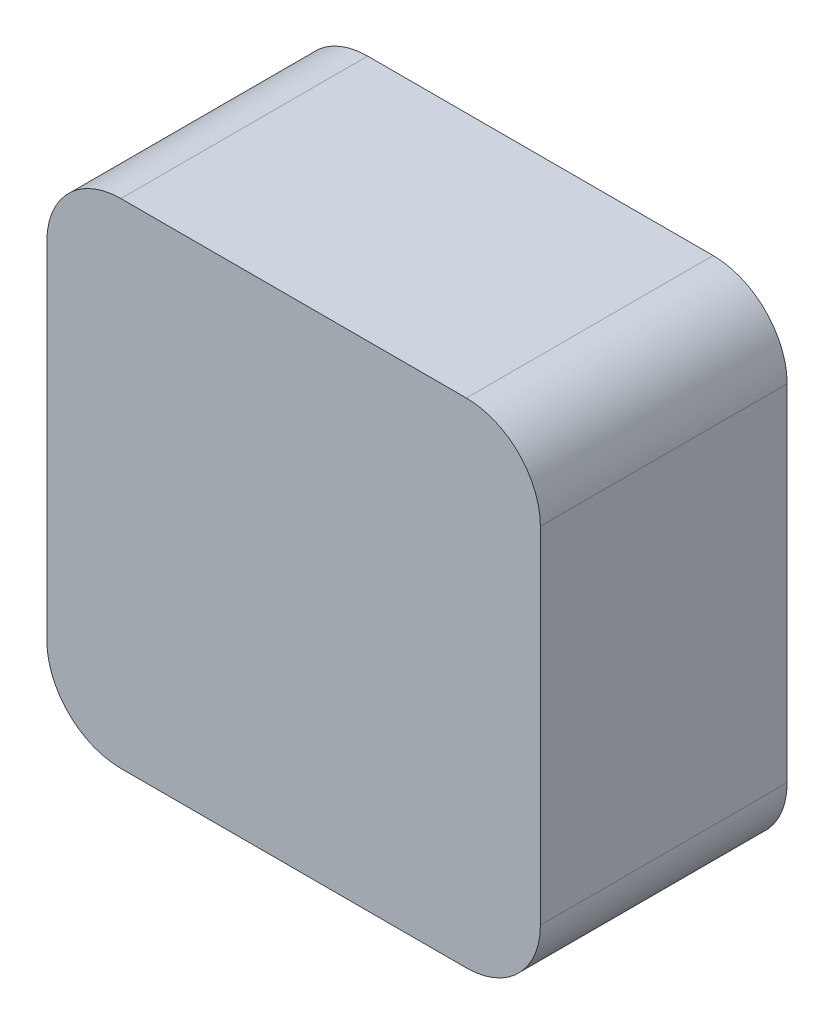
ISO-10303-21;
HEADER;
FILE_DESCRIPTION(('STEP AP214'),'2;1');
FILE_NAME('part.step','',(''),(''),'','','');
FILE_SCHEMA(('AUTOMOTIVE_DESIGN { 1 0 10303 214 1 1 1 1 }'));
ENDSEC;
DATA;
#1=APPLICATION_CONTEXT('core data for automotive mechanical design processes');
#2=APPLICATION_PROTOCOL_DEFINITION('international standard','automotive_design',2000,#1);
#3=PRODUCT_CONTEXT('',#1,'mechanical');
#4=PRODUCT('Part','Part','',(#3));
#5=PRODUCT_RELATED_PRODUCT_CATEGORY('part','',(#4));
#6=PRODUCT_DEFINITION_FORMATION('','',#4);
#7=PRODUCT_DEFINITION_CONTEXT('part definition',#1,'design');
#8=PRODUCT_DEFINITION('design','',#6,#7);
#9=PRODUCT_DEFINITION_SHAPE('','',#8);
#10=(LENGTH_UNIT() NAMED_UNIT(*) SI_UNIT(.MILLI.,.METRE.));
#11=(NAMED_UNIT(*) PLANE_ANGLE_UNIT() SI_UNIT($,.RADIAN.));
#12=(NAMED_UNIT(*) SI_UNIT($,.STERADIAN.) SOLID_ANGLE_UNIT());
#13=UNCERTAINTY_MEASURE_WITH_UNIT(LENGTH_MEASURE(1.E-05),#10,'distance_accuracy_value','');
#14=(GEOMETRIC_REPRESENTATION_CONTEXT(3) GLOBAL_UNCERTAINTY_ASSIGNED_CONTEXT((#13)) GLOBAL_UNIT_ASSIGNED_CONTEXT((#10,
#11,#12)) REPRESENTATION_CONTEXT('',''));
#15=CARTESIAN_POINT('',(0.,0.,0.));
#16=DIRECTION('',(0.,0.,1.));
#17=DIRECTION('',(1.,0.,0.));
#18=AXIS2_PLACEMENT_3D('',#15,#16,#17);
#19=CARTESIAN_POINT('',(0.,0.,5.));
#20=DIRECTION('',(0.,0.,1.));
#21=DIRECTION('',(1.,0.,0.));
#22=AXIS2_PLACEMENT_3D('',#19,#20,#21);
#23=PLANE('',#22);
#24=DIRECTION('',(0.,-1.,0.));
#25=VECTOR('',#24,1.);
#26=CARTESIAN_POINT('',(-145.000000000007,160.499999999999,5.));
#27=LINE('',#26,#25);
#28=CARTESIAN_POINT('',(-145.000000000007,158.999999999999,5.));
#29=VERTEX_POINT('',#28);
#30=CARTESIAN_POINT('',(-145.000000000007,151.999999999999,5.));
#31=VERTEX_POINT('',#30);
#32=EDGE_CURVE('E140',#29,#31,#27,.T.);
#33=ORIENTED_EDGE('',*,*,#32,.T.);
#34=CARTESIAN_POINT('',(-143.500000000007,151.999999999999,5.));
#35=DIRECTION('',(0.,0.,1.));
#36=DIRECTION('',(1.,0.,0.));
#37=AXIS2_PLACEMENT_3D('',#34,#35,#36);
#38=CIRCLE('',#37,1.5);
#39=CARTESIAN_POINT('',(-143.500000000007,150.499999999999,5.));
#40=VERTEX_POINT('',#39);
#41=EDGE_CURVE('E155',#31,#40,#38,.T.);
#42=ORIENTED_EDGE('',*,*,#41,.T.);
#43=DIRECTION('',(1.,0.,0.));
#44=VECTOR('',#43,1.);
#45=CARTESIAN_POINT('',(-145.000000000007,150.499999999999,5.));
#46=LINE('',#45,#44);
#47=CARTESIAN_POINT('',(-136.500000000007,150.499999999999,5.));
#48=VERTEX_POINT('',#47);
#49=EDGE_CURVE('E123',#40,#48,#46,.T.);
#50=ORIENTED_EDGE('',*,*,#49,.T.);
#51=CARTESIAN_POINT('',(-136.500000000007,151.999999999999,5.));
#52=DIRECTION('',(0.,0.,1.));
#53=DIRECTION('',(1.,0.,0.));
#54=AXIS2_PLACEMENT_3D('',#51,#52,#53);
#55=CIRCLE('',#54,1.5);
#56=CARTESIAN_POINT('',(-135.000000000007,151.999999999999,5.));
#57=VERTEX_POINT('',#56);
#58=EDGE_CURVE('E150',#48,#57,#55,.T.);
#59=ORIENTED_EDGE('',*,*,#58,.T.);
#60=DIRECTION('',(0.,1.,0.));
#61=VECTOR('',#60,1.);
#62=CARTESIAN_POINT('',(-135.000000000007,160.499999999999,5.));
#63=LINE('',#62,#61);
#64=CARTESIAN_POINT('',(-135.000000000007,158.999999999999,5.));
#65=VERTEX_POINT('',#64);
#66=EDGE_CURVE('E166',#57,#65,#63,.T.);
#67=ORIENTED_EDGE('',*,*,#66,.T.);
#68=CARTESIAN_POINT('',(-136.500000000007,158.999999999999,5.));
#69=DIRECTION('',(0.,0.,1.));
#70=DIRECTION('',(1.,0.,0.));
#71=AXIS2_PLACEMENT_3D('',#68,#69,#70);
#72=CIRCLE('',#71,1.5);
#73=CARTESIAN_POINT('',(-136.500000000007,160.499999999999,5.));
#74=VERTEX_POINT('',#73);
#75=EDGE_CURVE('E59',#65,#74,#72,.T.);
#76=ORIENTED_EDGE('',*,*,#75,.T.);
#77=DIRECTION('',(-1.,0.,0.));
#78=VECTOR('',#77,1.);
#79=CARTESIAN_POINT('',(-145.000000000007,160.499999999999,5.));
#80=LINE('',#79,#78);
#81=CARTESIAN_POINT('',(-143.500000000007,160.499999999999,5.));
#82=VERTEX_POINT('',#81);
#83=EDGE_CURVE('E141',#74,#82,#80,.T.);
#84=ORIENTED_EDGE('',*,*,#83,.T.);
#85=CARTESIAN_POINT('',(-143.500000000007,158.999999999999,5.));
#86=DIRECTION('',(0.,0.,1.));
#87=DIRECTION('',(1.,0.,0.));
#88=AXIS2_PLACEMENT_3D('',#85,#86,#87);
#89=CIRCLE('',#88,1.5);
#90=EDGE_CURVE('E153',#82,#29,#89,.T.);
#91=ORIENTED_EDGE('',*,*,#90,.T.);
#92=EDGE_LOOP('',(#33,#42,#50,#59,#67,#76,#84,#91));
#93=FACE_BOUND('',#92,.T.);
#94=ADVANCED_FACE('F37',(#93),#23,.T.);
#95=CARTESIAN_POINT('',(0.,0.,0.));
#96=DIRECTION('',(0.,0.,1.));
#97=DIRECTION('',(1.,0.,0.));
#98=AXIS2_PLACEMENT_3D('',#95,#96,#97);
#99=PLANE('',#98);
#100=CARTESIAN_POINT('',(-140.000000000007,155.499999999999,0.));
#101=DIRECTION('',(0.,0.,-1.));
#102=DIRECTION('',(-1.,0.,0.));
#103=AXIS2_PLACEMENT_3D('',#100,#101,#102);
#104=CIRCLE('',#103,2.25000000000001);
#105=CARTESIAN_POINT('',(-142.250000000007,155.499999999999,0.));
#106=VERTEX_POINT('',#105);
#107=EDGE_CURVE('E180',#106,#106,#104,.T.);
#108=ORIENTED_EDGE('',*,*,#107,.F.);
#109=EDGE_LOOP('',(#108));
#110=FACE_BOUND('',#109,.T.);
#111=DIRECTION('',(1.,0.,0.));
#112=VECTOR('',#111,1.);
#113=CARTESIAN_POINT('',(-145.000000000007,150.499999999999,0.));
#114=LINE('',#113,#112);
#115=CARTESIAN_POINT('',(-143.500000000007,150.499999999999,0.));
#116=VERTEX_POINT('',#115);
#117=CARTESIAN_POINT('',(-136.500000000007,150.499999999999,0.));
#118=VERTEX_POINT('',#117);
#119=EDGE_CURVE('E120',#116,#118,#114,.T.);
#120=ORIENTED_EDGE('',*,*,#119,.F.);
#121=CARTESIAN_POINT('',(-143.500000000007,151.999999999999,0.));
#122=DIRECTION('',(0.,0.,1.));
#123=DIRECTION('',(1.,0.,0.));
#124=AXIS2_PLACEMENT_3D('',#121,#122,#123);
#125=CIRCLE('',#124,1.5);
#126=CARTESIAN_POINT('',(-145.000000000007,151.999999999999,0.));
#127=VERTEX_POINT('',#126);
#128=EDGE_CURVE('E103',#116,#127,#125,.F.);
#129=ORIENTED_EDGE('',*,*,#128,.T.);
#130=DIRECTION('',(0.,-1.,0.));
#131=VECTOR('',#130,1.);
#132=CARTESIAN_POINT('',(-145.000000000007,160.499999999999,0.));
#133=LINE('',#132,#131);
#134=CARTESIAN_POINT('',(-145.000000000007,158.999999999999,0.));
#135=VERTEX_POINT('',#134);
#136=EDGE_CURVE('E130',#135,#127,#133,.T.);
#137=ORIENTED_EDGE('',*,*,#136,.F.);
#138=CARTESIAN_POINT('',(-143.500000000007,158.999999999999,0.));
#139=DIRECTION('',(0.,0.,1.));
#140=DIRECTION('',(1.,0.,0.));
#141=AXIS2_PLACEMENT_3D('',#138,#139,#140);
#142=CIRCLE('',#141,1.5);
#143=CARTESIAN_POINT('',(-143.500000000007,160.499999999999,0.));
#144=VERTEX_POINT('',#143);
#145=EDGE_CURVE('E114',#135,#144,#142,.F.);
#146=ORIENTED_EDGE('',*,*,#145,.T.);
#147=DIRECTION('',(-1.,0.,0.));
#148=VECTOR('',#147,1.);
#149=CARTESIAN_POINT('',(-145.000000000007,160.499999999999,0.));
#150=LINE('',#149,#148);
#151=CARTESIAN_POINT('',(-136.500000000007,160.499999999999,0.));
#152=VERTEX_POINT('',#151);
#153=EDGE_CURVE('E133',#152,#144,#150,.T.);
#154=ORIENTED_EDGE('',*,*,#153,.F.);
#155=CARTESIAN_POINT('',(-136.500000000007,158.999999999999,0.));
#156=DIRECTION('',(0.,0.,1.));
#157=DIRECTION('',(1.,0.,0.));
#158=AXIS2_PLACEMENT_3D('',#155,#156,#157);
#159=CIRCLE('',#158,1.5);
#160=CARTESIAN_POINT('',(-135.000000000007,158.999999999999,0.));
#161=VERTEX_POINT('',#160);
#162=EDGE_CURVE('E144',#152,#161,#159,.F.);
#163=ORIENTED_EDGE('',*,*,#162,.T.);
#164=DIRECTION('',(0.,1.,0.));
#165=VECTOR('',#164,1.);
#166=CARTESIAN_POINT('',(-135.000000000007,160.499999999999,0.));
#167=LINE('',#166,#165);
#168=CARTESIAN_POINT('',(-135.000000000007,151.999999999999,0.));
#169=VERTEX_POINT('',#168);
#170=EDGE_CURVE('E129',#169,#161,#167,.T.);
#171=ORIENTED_EDGE('',*,*,#170,.F.);
#172=CARTESIAN_POINT('',(-136.500000000007,151.999999999999,0.));
#173=DIRECTION('',(0.,0.,1.));
#174=DIRECTION('',(1.,0.,0.));
#175=AXIS2_PLACEMENT_3D('',#172,#173,#174);
#176=CIRCLE('',#175,1.5);
#177=EDGE_CURVE('E124',#169,#118,#176,.F.);
#178=ORIENTED_EDGE('',*,*,#177,.T.);
#179=EDGE_LOOP('',(#120,#129,#137,#146,#154,#163,#171,#178));
#180=FACE_BOUND('',#179,.T.);
#181=ADVANCED_FACE('F127',(#110,#180),#99,.F.);
#182=CARTESIAN_POINT('',(-145.000000000007,160.499999999999,5.));
#183=DIRECTION('',(1.,0.,0.));
#184=DIRECTION('',(0.,0.,-1.));
#185=AXIS2_PLACEMENT_3D('',#182,#183,#184);
#186=PLANE('',#185);
#187=ORIENTED_EDGE('',*,*,#136,.T.);
#188=DIRECTION('',(0.,0.,-1.));
#189=VECTOR('',#188,1.);
#190=CARTESIAN_POINT('',(-145.000000000007,151.999999999999,5.));
#191=LINE('',#190,#189);
#192=EDGE_CURVE('E108',#127,#31,#191,.F.);
#193=ORIENTED_EDGE('',*,*,#192,.T.);
#194=ORIENTED_EDGE('',*,*,#32,.F.);
#195=DIRECTION('',(0.,0.,-1.));
#196=VECTOR('',#195,1.);
#197=CARTESIAN_POINT('',(-145.000000000007,158.999999999999,5.));
#198=LINE('',#197,#196);
#199=EDGE_CURVE('E113',#29,#135,#198,.T.);
#200=ORIENTED_EDGE('',*,*,#199,.T.);
#201=EDGE_LOOP('',(#187,#193,#194,#200));
#202=FACE_BOUND('',#201,.T.);
#203=ADVANCED_FACE('F195',(#202),#186,.F.);
#204=CARTESIAN_POINT('',(-145.000000000007,150.499999999999,5.));
#205=DIRECTION('',(0.,1.,0.));
#206=DIRECTION('',(0.,0.,1.));
#207=AXIS2_PLACEMENT_3D('',#204,#205,#206);
#208=PLANE('',#207);
#209=ORIENTED_EDGE('',*,*,#49,.F.);
#210=DIRECTION('',(0.,0.,-1.));
#211=VECTOR('',#210,1.);
#212=CARTESIAN_POINT('',(-143.500000000007,150.499999999999,5.));
#213=LINE('',#212,#211);
#214=EDGE_CURVE('E107',#40,#116,#213,.T.);
#215=ORIENTED_EDGE('',*,*,#214,.T.);
#216=ORIENTED_EDGE('',*,*,#119,.T.);
#217=DIRECTION('',(0.,0.,-1.));
#218=VECTOR('',#217,1.);
#219=CARTESIAN_POINT('',(-136.500000000007,150.499999999999,5.));
#220=LINE('',#219,#218);
#221=EDGE_CURVE('E125',#118,#48,#220,.F.);
#222=ORIENTED_EDGE('',*,*,#221,.T.);
#223=EDGE_LOOP('',(#209,#215,#216,#222));
#224=FACE_BOUND('',#223,.T.);
#225=ADVANCED_FACE('F119',(#224),#208,.F.);
#226=CARTESIAN_POINT('',(-135.000000000007,160.499999999999,5.));
#227=DIRECTION('',(-1.,0.,0.));
#228=DIRECTION('',(0.,0.,1.));
#229=AXIS2_PLACEMENT_3D('',#226,#227,#228);
#230=PLANE('',#229);
#231=ORIENTED_EDGE('',*,*,#170,.T.);
#232=DIRECTION('',(0.,0.,-1.));
#233=VECTOR('',#232,1.);
#234=CARTESIAN_POINT('',(-135.000000000007,158.999999999999,5.));
#235=LINE('',#234,#233);
#236=EDGE_CURVE('E11',#161,#65,#235,.F.);
#237=ORIENTED_EDGE('',*,*,#236,.T.);
#238=ORIENTED_EDGE('',*,*,#66,.F.);
#239=DIRECTION('',(0.,0.,-1.));
#240=VECTOR('',#239,1.);
#241=CARTESIAN_POINT('',(-135.000000000007,151.999999999999,5.));
#242=LINE('',#241,#240);
#243=EDGE_CURVE('E45',#57,#169,#242,.T.);
#244=ORIENTED_EDGE('',*,*,#243,.T.);
#245=EDGE_LOOP('',(#231,#237,#238,#244));
#246=FACE_BOUND('',#245,.T.);
#247=ADVANCED_FACE('F164',(#246),#230,.F.);
#248=CARTESIAN_POINT('',(-145.000000000007,160.499999999999,5.));
#249=DIRECTION('',(0.,-1.,0.));
#250=DIRECTION('',(0.,0.,-1.));
#251=AXIS2_PLACEMENT_3D('',#248,#249,#250);
#252=PLANE('',#251);
#253=ORIENTED_EDGE('',*,*,#153,.T.);
#254=DIRECTION('',(0.,0.,-1.));
#255=VECTOR('',#254,1.);
#256=CARTESIAN_POINT('',(-143.500000000007,160.499999999999,5.));
#257=LINE('',#256,#255);
#258=EDGE_CURVE('E52',#144,#82,#257,.F.);
#259=ORIENTED_EDGE('',*,*,#258,.T.);
#260=ORIENTED_EDGE('',*,*,#83,.F.);
#261=DIRECTION('',(0.,0.,-1.));
#262=VECTOR('',#261,1.);
#263=CARTESIAN_POINT('',(-136.500000000007,160.499999999999,5.));
#264=LINE('',#263,#262);
#265=EDGE_CURVE('E157',#74,#152,#264,.T.);
#266=ORIENTED_EDGE('',*,*,#265,.T.);
#267=EDGE_LOOP('',(#253,#259,#260,#266));
#268=FACE_BOUND('',#267,.T.);
#269=ADVANCED_FACE('F173',(#268),#252,.F.);
#270=CARTESIAN_POINT('',(-143.500000000007,151.999999999999,5.));
#271=DIRECTION('',(0.,0.,-1.));
#272=DIRECTION('',(-1.,0.,0.));
#273=AXIS2_PLACEMENT_3D('',#270,#271,#272);
#274=CYLINDRICAL_SURFACE('',#273,1.5);
#275=ORIENTED_EDGE('',*,*,#41,.F.);
#276=ORIENTED_EDGE('',*,*,#192,.F.);
#277=ORIENTED_EDGE('',*,*,#128,.F.);
#278=ORIENTED_EDGE('',*,*,#214,.F.);
#279=EDGE_LOOP('',(#275,#276,#277,#278));
#280=FACE_BOUND('',#279,.T.);
#281=ADVANCED_FACE('F106',(#280),#274,.T.);
#282=CARTESIAN_POINT('',(-143.500000000007,158.999999999999,5.));
#283=DIRECTION('',(0.,0.,-1.));
#284=DIRECTION('',(-1.,0.,0.));
#285=AXIS2_PLACEMENT_3D('',#282,#283,#284);
#286=CYLINDRICAL_SURFACE('',#285,1.5);
#287=ORIENTED_EDGE('',*,*,#90,.F.);
#288=ORIENTED_EDGE('',*,*,#258,.F.);
#289=ORIENTED_EDGE('',*,*,#145,.F.);
#290=ORIENTED_EDGE('',*,*,#199,.F.);
#291=EDGE_LOOP('',(#287,#288,#289,#290));
#292=FACE_BOUND('',#291,.T.);
#293=ADVANCED_FACE('F214',(#292),#286,.T.);
#294=CARTESIAN_POINT('',(-136.500000000007,158.999999999999,5.));
#295=DIRECTION('',(0.,0.,-1.));
#296=DIRECTION('',(-1.,0.,0.));
#297=AXIS2_PLACEMENT_3D('',#294,#295,#296);
#298=CYLINDRICAL_SURFACE('',#297,1.5);
#299=ORIENTED_EDGE('',*,*,#75,.F.);
#300=ORIENTED_EDGE('',*,*,#236,.F.);
#301=ORIENTED_EDGE('',*,*,#162,.F.);
#302=ORIENTED_EDGE('',*,*,#265,.F.);
#303=EDGE_LOOP('',(#299,#300,#301,#302));
#304=FACE_BOUND('',#303,.T.);
#305=ADVANCED_FACE('F172',(#304),#298,.T.);
#306=CARTESIAN_POINT('',(-136.500000000007,151.999999999999,5.));
#307=DIRECTION('',(0.,0.,-1.));
#308=DIRECTION('',(-1.,0.,0.));
#309=AXIS2_PLACEMENT_3D('',#306,#307,#308);
#310=CYLINDRICAL_SURFACE('',#309,1.5);
#311=ORIENTED_EDGE('',*,*,#58,.F.);
#312=ORIENTED_EDGE('',*,*,#221,.F.);
#313=ORIENTED_EDGE('',*,*,#177,.F.);
#314=ORIENTED_EDGE('',*,*,#243,.F.);
#315=EDGE_LOOP('',(#311,#312,#313,#314));
#316=FACE_BOUND('',#315,.T.);
#317=ADVANCED_FACE('F39',(#316),#310,.T.);
#318=CARTESIAN_POINT('',(-140.000000000007,155.499999999999,4.));
#319=DIRECTION('',(0.,0.,-1.));
#320=DIRECTION('',(-1.,0.,0.));
#321=AXIS2_PLACEMENT_3D('',#318,#319,#320);
#322=CYLINDRICAL_SURFACE('',#321,2.25000000000001);
#323=CARTESIAN_POINT('',(-140.000000000007,155.499999999999,4.));
#324=DIRECTION('',(0.,0.,-1.));
#325=DIRECTION('',(-1.,0.,0.));
#326=AXIS2_PLACEMENT_3D('',#323,#324,#325);
#327=CIRCLE('',#326,2.25000000000001);
#328=CARTESIAN_POINT('',(-142.250000000007,155.499999999999,4.));
#329=VERTEX_POINT('',#328);
#330=EDGE_CURVE('E135',#329,#329,#327,.T.);
#331=ORIENTED_EDGE('',*,*,#330,.F.);
#332=EDGE_LOOP('',(#331));
#333=FACE_BOUND('',#332,.T.);
#334=ORIENTED_EDGE('',*,*,#107,.T.);
#335=EDGE_LOOP('',(#334));
#336=FACE_BOUND('',#335,.T.);
#337=ADVANCED_FACE('F188',(#333,#336),#322,.F.);
#338=CARTESIAN_POINT('',(-140.000000000007,155.499999999999,4.));
#339=DIRECTION('',(0.,0.,1.));
#340=DIRECTION('',(1.,0.,0.));
#341=AXIS2_PLACEMENT_3D('',#338,#339,#340);
#342=PLANE('',#341);
#343=ORIENTED_EDGE('',*,*,#330,.T.);
#344=EDGE_LOOP('',(#343));
#345=FACE_BOUND('',#344,.T.);
#346=ADVANCED_FACE('F186',(#345),#342,.F.);
#347=CLOSED_SHELL('',(#94,#181,#203,#225,#247,#269,#281,#293,#305,#317,#337,#346));
#348=MANIFOLD_SOLID_BREP('B2',#347);
#349=ADVANCED_BREP_SHAPE_REPRESENTATION('',(#18,#348),#14);
#350=SHAPE_DEFINITION_REPRESENTATION(#9,#349);
ENDSEC;
END-ISO-10303-21;
